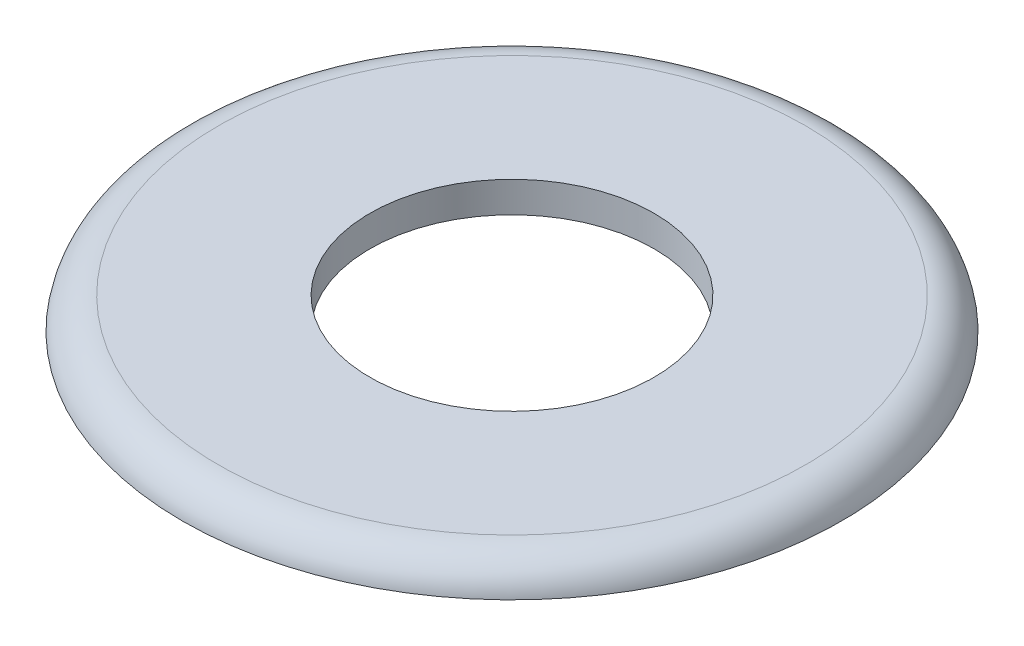
ISO-10303-21;
HEADER;
FILE_DESCRIPTION(('STEP AP214'),'2;1');
FILE_NAME('part.step','',(''),(''),'','','');
FILE_SCHEMA(('AUTOMOTIVE_DESIGN { 1 0 10303 214 1 1 1 1 }'));
ENDSEC;
DATA;
#1=APPLICATION_CONTEXT('core data for automotive mechanical design processes');
#2=APPLICATION_PROTOCOL_DEFINITION('international standard','automotive_design',2000,#1);
#3=PRODUCT_CONTEXT('',#1,'mechanical');
#4=PRODUCT('Part','Part','',(#3));
#5=PRODUCT_RELATED_PRODUCT_CATEGORY('part','',(#4));
#6=PRODUCT_DEFINITION_FORMATION('','',#4);
#7=PRODUCT_DEFINITION_CONTEXT('part definition',#1,'design');
#8=PRODUCT_DEFINITION('design','',#6,#7);
#9=PRODUCT_DEFINITION_SHAPE('','',#8);
#10=(LENGTH_UNIT() NAMED_UNIT(*) SI_UNIT(.MILLI.,.METRE.));
#11=(NAMED_UNIT(*) PLANE_ANGLE_UNIT() SI_UNIT($,.RADIAN.));
#12=(NAMED_UNIT(*) SI_UNIT($,.STERADIAN.) SOLID_ANGLE_UNIT());
#13=UNCERTAINTY_MEASURE_WITH_UNIT(LENGTH_MEASURE(1.E-05),#10,'distance_accuracy_value','');
#14=(GEOMETRIC_REPRESENTATION_CONTEXT(3) GLOBAL_UNCERTAINTY_ASSIGNED_CONTEXT((#13)) GLOBAL_UNIT_ASSIGNED_CONTEXT((#10,
#11,#12)) REPRESENTATION_CONTEXT('',''));
#15=CARTESIAN_POINT('',(0.,0.,0.));
#16=DIRECTION('',(0.,0.,1.));
#17=DIRECTION('',(1.,0.,0.));
#18=AXIS2_PLACEMENT_3D('',#15,#16,#17);
#19=CARTESIAN_POINT('',(0.,4.137025,-4.03489583333334));
#20=DIRECTION('',(0.,1.,0.));
#21=DIRECTION('',(0.,0.,1.));
#22=AXIS2_PLACEMENT_3D('',#19,#20,#21);
#23=PLANE('',#22);
#24=CARTESIAN_POINT('',(0.,4.137025,0.));
#25=DIRECTION('',(0.,-1.,0.));
#26=DIRECTION('',(0.,0.,-1.));
#27=AXIS2_PLACEMENT_3D('',#24,#25,#26);
#28=CIRCLE('',#27,1.95263971166468);
#29=CARTESIAN_POINT('',(0.,4.137025,-1.95263971166468));
#30=VERTEX_POINT('',#29);
#31=EDGE_CURVE('E19',#30,#30,#28,.T.);
#32=ORIENTED_EDGE('',*,*,#31,.T.);
#33=EDGE_LOOP('',(#32));
#34=FACE_BOUND('',#33,.T.);
#35=CARTESIAN_POINT('',(0.,4.137025,0.));
#36=DIRECTION('',(0.,-1.,0.));
#37=DIRECTION('',(0.,0.,-1.));
#38=AXIS2_PLACEMENT_3D('',#35,#36,#37);
#39=CIRCLE('',#38,4.03489583333334);
#40=CARTESIAN_POINT('',(0.,4.137025,-4.03489583333334));
#41=VERTEX_POINT('',#40);
#42=EDGE_CURVE('E51',#41,#41,#39,.T.);
#43=ORIENTED_EDGE('',*,*,#42,.F.);
#44=EDGE_LOOP('',(#43));
#45=FACE_BOUND('',#44,.T.);
#46=ADVANCED_FACE('F15',(#34,#45),#23,.T.);
#47=CARTESIAN_POINT('',(0.,3.63802083333334,0.));
#48=DIRECTION('',(0.,-1.,0.));
#49=DIRECTION('',(0.,0.,-1.));
#50=AXIS2_PLACEMENT_3D('',#47,#48,#49);
#51=TOROIDAL_SURFACE('',#50,4.03489583333334,0.499004166666658);
#52=CARTESIAN_POINT('',(0.,3.71422083333334,0.));
#53=DIRECTION('',(0.,-1.,0.));
#54=DIRECTION('',(0.,0.,-1.));
#55=AXIS2_PLACEMENT_3D('',#52,#53,#54);
#56=CIRCLE('',#55,4.52804765412557);
#57=CARTESIAN_POINT('',(0.,3.71422083333334,-4.52804765412557));
#58=VERTEX_POINT('',#57);
#59=EDGE_CURVE('E23',#58,#58,#56,.T.);
#60=ORIENTED_EDGE('',*,*,#59,.F.);
#61=EDGE_LOOP('',(#60));
#62=FACE_BOUND('',#61,.T.);
#63=ORIENTED_EDGE('',*,*,#42,.T.);
#64=EDGE_LOOP('',(#63));
#65=FACE_BOUND('',#64,.T.);
#66=ADVANCED_FACE('F34',(#62,#65),#51,.T.);
#67=CARTESIAN_POINT('',(0.,3.71422083333334,0.));
#68=DIRECTION('',(0.,-1.,0.));
#69=DIRECTION('',(0.,0.,-1.));
#70=AXIS2_PLACEMENT_3D('',#67,#68,#69);
#71=CYLINDRICAL_SURFACE('',#70,1.95263971166468);
#72=ORIENTED_EDGE('',*,*,#31,.F.);
#73=EDGE_LOOP('',(#72));
#74=FACE_BOUND('',#73,.T.);
#75=CARTESIAN_POINT('',(0.,3.71422083333334,0.));
#76=DIRECTION('',(0.,-1.,0.));
#77=DIRECTION('',(0.,0.,-1.));
#78=AXIS2_PLACEMENT_3D('',#75,#76,#77);
#79=CIRCLE('',#78,1.95263971166468);
#80=CARTESIAN_POINT('',(0.,3.71422083333334,-1.95263971166468));
#81=VERTEX_POINT('',#80);
#82=EDGE_CURVE('E10',#81,#81,#79,.F.);
#83=ORIENTED_EDGE('',*,*,#82,.F.);
#84=EDGE_LOOP('',(#83));
#85=FACE_BOUND('',#84,.T.);
#86=ADVANCED_FACE('F44',(#74,#85),#71,.F.);
#87=CARTESIAN_POINT('',(0.,3.71422083333334,-1.95263971166468));
#88=DIRECTION('',(0.,-1.,0.));
#89=DIRECTION('',(0.,0.,-1.));
#90=AXIS2_PLACEMENT_3D('',#87,#88,#89);
#91=PLANE('',#90);
#92=ORIENTED_EDGE('',*,*,#82,.T.);
#93=EDGE_LOOP('',(#92));
#94=FACE_BOUND('',#93,.T.);
#95=ORIENTED_EDGE('',*,*,#59,.T.);
#96=EDGE_LOOP('',(#95));
#97=FACE_BOUND('',#96,.T.);
#98=ADVANCED_FACE('F66',(#94,#97),#91,.T.);
#99=CLOSED_SHELL('',(#46,#66,#86,#98));
#100=MANIFOLD_SOLID_BREP('B1',#99);
#101=ADVANCED_BREP_SHAPE_REPRESENTATION('',(#18,#100),#14);
#102=SHAPE_DEFINITION_REPRESENTATION(#9,#101);
ENDSEC;
END-ISO-10303-21;
